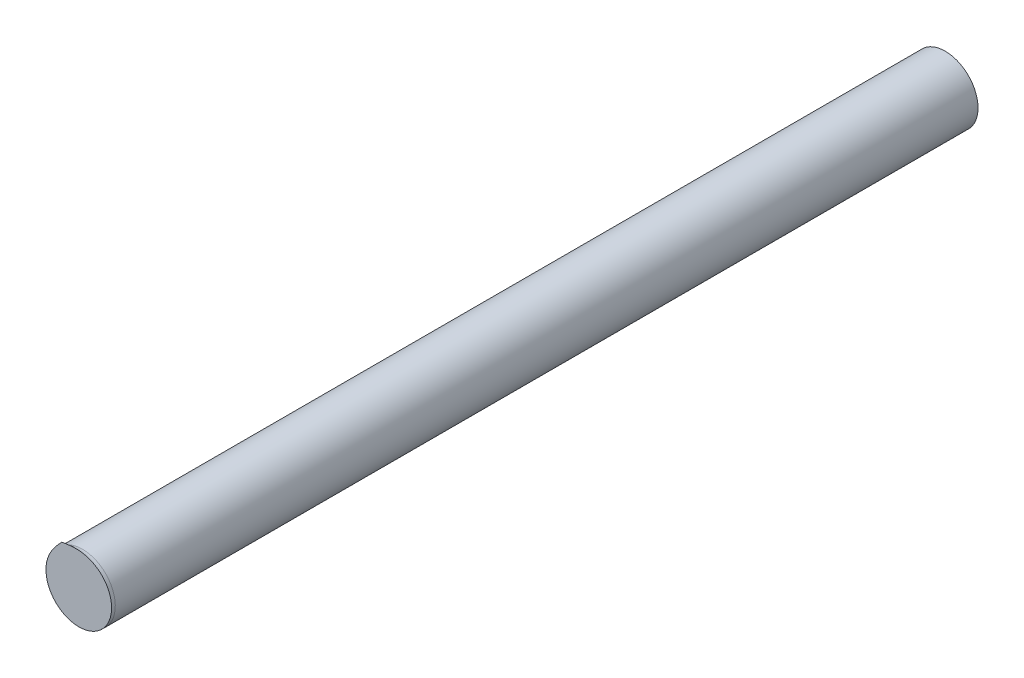
ISO-10303-21;
HEADER;
FILE_DESCRIPTION(('STEP AP214'),'2;1');
FILE_NAME('part.step','',(''),(''),'','','');
FILE_SCHEMA(('AUTOMOTIVE_DESIGN { 1 0 10303 214 1 1 1 1 }'));
ENDSEC;
DATA;
#1=APPLICATION_CONTEXT('core data for automotive mechanical design processes');
#2=APPLICATION_PROTOCOL_DEFINITION('international standard','automotive_design',2000,#1);
#3=PRODUCT_CONTEXT('',#1,'mechanical');
#4=PRODUCT('Part','Part','',(#3));
#5=PRODUCT_RELATED_PRODUCT_CATEGORY('part','',(#4));
#6=PRODUCT_DEFINITION_FORMATION('','',#4);
#7=PRODUCT_DEFINITION_CONTEXT('part definition',#1,'design');
#8=PRODUCT_DEFINITION('design','',#6,#7);
#9=PRODUCT_DEFINITION_SHAPE('','',#8);
#10=(LENGTH_UNIT() NAMED_UNIT(*) SI_UNIT(.MILLI.,.METRE.));
#11=(NAMED_UNIT(*) PLANE_ANGLE_UNIT() SI_UNIT($,.RADIAN.));
#12=(NAMED_UNIT(*) SI_UNIT($,.STERADIAN.) SOLID_ANGLE_UNIT());
#13=UNCERTAINTY_MEASURE_WITH_UNIT(LENGTH_MEASURE(1.E-05),#10,'distance_accuracy_value','');
#14=(GEOMETRIC_REPRESENTATION_CONTEXT(3) GLOBAL_UNCERTAINTY_ASSIGNED_CONTEXT((#13)) GLOBAL_UNIT_ASSIGNED_CONTEXT((#10,
#11,#12)) REPRESENTATION_CONTEXT('',''));
#15=CARTESIAN_POINT('',(0.,0.,0.));
#16=DIRECTION('',(0.,0.,1.));
#17=DIRECTION('',(1.,0.,0.));
#18=AXIS2_PLACEMENT_3D('',#15,#16,#17);
#19=CARTESIAN_POINT('',(2.55246250659386,0.304851094896286,-7.3152));
#20=DIRECTION('',(0.,0.,-1.));
#21=DIRECTION('',(-1.,0.,0.));
#22=AXIS2_PLACEMENT_3D('',#19,#20,#21);
#23=PLANE('',#22);
#24=CARTESIAN_POINT('',(2.55246250659386,0.304851094896286,-7.3152));
#25=DIRECTION('',(0.,0.,1.));
#26=DIRECTION('',(-0.467775560933805,0.88384728578701,0.));
#27=AXIS2_PLACEMENT_3D('',#24,#25,#26);
#28=CIRCLE('',#27,0.228600000000229);
#29=CARTESIAN_POINT('',(2.44552901336428,0.506898584427399,-7.3152));
#30=VERTEX_POINT('',#29);
#31=EDGE_CURVE('E11',#30,#30,#28,.T.);
#32=ORIENTED_EDGE('',*,*,#31,.F.);
#33=EDGE_LOOP('',(#32));
#34=FACE_BOUND('',#33,.T.);
#35=ADVANCED_FACE('F16',(#34),#23,.T.);
#36=CARTESIAN_POINT('',(2.55246250659386,0.304851094896286,-1.175004));
#37=DIRECTION('',(0.,0.,1.));
#38=DIRECTION('',(1.,0.,0.));
#39=AXIS2_PLACEMENT_3D('',#36,#37,#38);
#40=CYLINDRICAL_SURFACE('',#39,0.228600000000229);
#41=CARTESIAN_POINT('',(2.55246250659386,0.304851094896286,-1.2954));
#42=DIRECTION('',(0.,0.,1.));
#43=DIRECTION('',(0.467775560933805,-0.88384728578701,0.));
#44=AXIS2_PLACEMENT_3D('',#41,#42,#43);
#45=CIRCLE('',#44,0.228600000000229);
#46=CARTESIAN_POINT('',(2.65939599982343,0.102803605365174,-1.2954));
#47=VERTEX_POINT('',#46);
#48=EDGE_CURVE('E38',#47,#47,#45,.T.);
#49=ORIENTED_EDGE('',*,*,#48,.F.);
#50=EDGE_LOOP('',(#49));
#51=FACE_BOUND('',#50,.T.);
#52=ORIENTED_EDGE('',*,*,#31,.T.);
#53=EDGE_LOOP('',(#52));
#54=FACE_BOUND('',#53,.T.);
#55=ADVANCED_FACE('F50',(#51,#54),#40,.T.);
#56=CARTESIAN_POINT('',(2.55171172482898,0.3083632925686,-1.27));
#57=DIRECTION('',(0.,0.,1.));
#58=DIRECTION('',(1.,0.,0.));
#59=AXIS2_PLACEMENT_3D('',#56,#57,#58);
#60=PLANE('',#59);
#61=CARTESIAN_POINT('',(2.43364751411612,0.529348305486184,-1.27));
#62=CARTESIAN_POINT('',(2.42635052586074,0.521705783658482,-1.27));
#63=CARTESIAN_POINT('',(2.41254253847296,0.50720824298433,-1.27));
#64=CARTESIAN_POINT('',(2.39498799944063,0.487482414724102,-1.27));
#65=CARTESIAN_POINT('',(2.38012104805445,0.468948764031,-1.27));
#66=CARTESIAN_POINT('',(2.36751971721373,0.451136015617706,-1.27));
#67=CARTESIAN_POINT('',(2.356699596837,0.433497909899068,-1.27));
#68=CARTESIAN_POINT('',(2.34735019283277,0.415581999554176,-1.27));
#69=CARTESIAN_POINT('',(2.33919463154169,0.396685331612256,-1.27));
#70=CARTESIAN_POINT('',(2.33217170798558,0.376002038655074,-1.27));
#71=CARTESIAN_POINT('',(2.32651085980794,0.352605321209588,-1.27));
#72=CARTESIAN_POINT('',(2.32299404119821,0.32632483289259,-1.27));
#73=CARTESIAN_POINT('',(2.32246704625931,0.298825239669382,-1.27));
#74=CARTESIAN_POINT('',(2.32522895927395,0.270956818123888,-1.27));
#75=CARTESIAN_POINT('',(2.33123212224982,0.24387660314277,-1.27));
#76=CARTESIAN_POINT('',(2.3403209024484,0.217898868684602,-1.27));
#77=CARTESIAN_POINT('',(2.35231898357233,0.193341783894628,-1.27));
#78=CARTESIAN_POINT('',(2.36720094291656,0.170278263526688,-1.27));
#79=CARTESIAN_POINT('',(2.38459348013345,0.149280035834302,-1.27));
#80=CARTESIAN_POINT('',(2.40440048275635,0.130437856967681,-1.27));
#81=CARTESIAN_POINT('',(2.42618752668712,0.114157260826678,-1.27));
#82=CARTESIAN_POINT('',(2.44982811139062,0.100525664071536,-1.27));
#83=CARTESIAN_POINT('',(2.47480796386693,0.0898389845322888,-1.27));
#84=CARTESIAN_POINT('',(2.5009554002415,0.082163556756632,-1.27));
#85=CARTESIAN_POINT('',(2.52773443461297,0.0776582514923304,-1.27));
#86=CARTESIAN_POINT('',(2.55492577236582,0.0763534849951884,-1.27));
#87=CARTESIAN_POINT('',(2.58201242485992,0.0782789502587028,-1.27));
#88=CARTESIAN_POINT('',(2.60871851038846,0.0834042523099578,-1.27));
#89=CARTESIAN_POINT('',(2.63461812112152,0.0916649197247596,-1.27));
#90=CARTESIAN_POINT('',(2.65105288239722,0.0991448037875676,-1.27));
#91=CARTESIAN_POINT('',(2.65908311195776,0.10339479719493,-1.27));
#92=B_SPLINE_CURVE_WITH_KNOTS('',3,(#61,#62,#63,#64,#65,#66,#67,#68,#69,#70,#71,#72,#73,#74,#75,
#76,#77,#78,#79,#80,#81,#82,#83,#84,#85,#86,#87,#88,#89,#90,#91),.UNSPECIFIED.,.F.,.F.,(4,1,1,1,
1,1,1,1,1,1,1,1,1,1,1,1,1,1,1,1,1,1,1,1,1,1,1,1,4),(0.,0.03571428571429,0.07142857142857,
0.1071428571429,0.1428571428571,0.1785714285714,0.2142857142857,0.25,0.2857142857143,
0.3214285714286,0.3571428571429,0.3928571428571,0.4285714285714,0.4642857142857,0.5,
0.5357142857143,0.5714285714286,0.6071428571429,0.6428571428571,0.6785714285714,0.7142857142857,
0.75,0.7857142857143,0.8214285714286,0.8571428571429,0.8928571428571,0.9285714285714,
0.9642857142857,1.),.UNSPECIFIED.);
#93=CARTESIAN_POINT('',(2.43364751411612,0.529348305486184,-1.27));
#94=VERTEX_POINT('',#93);
#95=CARTESIAN_POINT('',(2.65908311195776,0.10339479719493,-1.27));
#96=VERTEX_POINT('',#95);
#97=EDGE_CURVE('E28',#94,#96,#92,.T.);
#98=ORIENTED_EDGE('',*,*,#97,.T.);
#99=CARTESIAN_POINT('',(2.43364751411612,0.529348305486184,-1.27));
#100=CARTESIAN_POINT('',(2.44418065560097,0.531102455274042,-1.27));
#101=CARTESIAN_POINT('',(2.46411770000747,0.534396471309568,-1.27));
#102=CARTESIAN_POINT('',(2.4904685074546,0.537822781515608,-1.27));
#103=CARTESIAN_POINT('',(2.51422193097687,0.53966891585813,-1.27));
#104=CARTESIAN_POINT('',(2.53604570067747,0.54003576303401,-1.27));
#105=CARTESIAN_POINT('',(2.55659948343546,0.539033043916516,-1.27));
#106=CARTESIAN_POINT('',(2.57645770606336,0.536690522003652,-1.27));
#107=CARTESIAN_POINT('',(2.59651388437358,0.532827493612122,-1.27));
#108=CARTESIAN_POINT('',(2.6175217094343,0.527022637428106,-1.27));
#109=CARTESIAN_POINT('',(2.64025162361878,0.518451324381282,-1.27));
#110=CARTESIAN_POINT('',(2.66374940811664,0.506666280142172,-1.27));
#111=CARTESIAN_POINT('',(2.68687190022818,0.49159318911036,-1.27));
#112=CARTESIAN_POINT('',(2.70853894100374,0.473447653261042,-1.27));
#113=CARTESIAN_POINT('',(2.7274960320938,0.453244266740286,-1.27));
#114=CARTESIAN_POINT('',(2.74377911403608,0.431189247508274,-1.27));
#115=CARTESIAN_POINT('',(2.75732219694224,0.407436723999446,-1.27));
#116=CARTESIAN_POINT('',(2.76799197849062,0.382169968642278,-1.27));
#117=CARTESIAN_POINT('',(2.77555152886806,0.355967893795326,-1.27));
#118=CARTESIAN_POINT('',(2.7799641273225,0.329032941946008,-1.27));
#119=CARTESIAN_POINT('',(2.78115453890916,0.301858548684794,-1.27));
#120=CARTESIAN_POINT('',(2.77911705729706,0.274684720949246,-1.27));
#121=CARTESIAN_POINT('',(2.77388952046234,0.248017301107052,-1.27));
#122=CARTESIAN_POINT('',(2.76553188406106,0.222124158301646,-1.27));
#123=CARTESIAN_POINT('',(2.75418611428122,0.197448521172247,-1.27));
#124=CARTESIAN_POINT('',(2.73998609838108,0.174268833433874,-1.27));
#125=CARTESIAN_POINT('',(2.72315520862408,0.152956688043721,-1.27));
#126=CARTESIAN_POINT('',(2.70391750906044,0.133782725866398,-1.27));
#127=CARTESIAN_POINT('',(2.68252496309022,0.117017292662838,-1.27));
#128=CARTESIAN_POINT('',(2.66710764894142,0.10764177780908,-1.27));
#129=CARTESIAN_POINT('',(2.65908311195776,0.10339479719493,-1.27));
#130=B_SPLINE_CURVE_WITH_KNOTS('',3,(#99,#100,#101,#102,#103,#104,#105,#106,#107,#108,#109,#110,
#111,#112,#113,#114,#115,#116,#117,#118,#119,#120,#121,#122,#123,#124,#125,#126,#127,#128,#129),
.UNSPECIFIED.,.F.,.F.,(4,1,1,1,1,1,1,1,1,1,1,1,1,1,1,1,1,1,1,1,1,1,1,1,1,1,1,1,4),(0.,
0.03571428571429,0.07142857142857,0.1071428571429,0.1428571428571,0.1785714285714,
0.2142857142857,0.25,0.2857142857143,0.3214285714286,0.3571428571429,0.3928571428571,
0.4285714285714,0.4642857142857,0.5,0.5357142857143,0.5714285714286,0.6071428571429,
0.6428571428571,0.6785714285714,0.7142857142857,0.75,0.7857142857143,0.8214285714286,
0.8571428571429,0.8928571428571,0.9285714285714,0.9642857142857,1.),.UNSPECIFIED.);
#131=EDGE_CURVE('E21',#94,#96,#130,.T.);
#132=ORIENTED_EDGE('',*,*,#131,.F.);
#133=EDGE_LOOP('',(#98,#132));
#134=FACE_BOUND('',#133,.T.);
#135=ADVANCED_FACE('F37',(#134),#60,.T.);
#136=CARTESIAN_POINT('',(2.43364751411612,0.529348305486184,-1.2954));
#137=DIRECTION('',(0.883847285787051,0.467775560933727,0.));
#138=DIRECTION('',(0.,0.,-1.));
#139=AXIS2_PLACEMENT_3D('',#136,#137,#138);
#140=TOROIDAL_SURFACE('',#139,0.254,0.2286);
#141=ORIENTED_EDGE('',*,*,#97,.F.);
#142=ORIENTED_EDGE('',*,*,#131,.T.);
#143=EDGE_LOOP('',(#141,#142));
#144=FACE_BOUND('',#143,.T.);
#145=ORIENTED_EDGE('',*,*,#48,.T.);
#146=EDGE_LOOP('',(#145));
#147=FACE_BOUND('',#146,.T.);
#148=ADVANCED_FACE('F18',(#144,#147),#140,.T.);
#149=CLOSED_SHELL('',(#35,#55,#135,#148));
#150=MANIFOLD_SOLID_BREP('B1',#149);
#151=ADVANCED_BREP_SHAPE_REPRESENTATION('',(#18,#150),#14);
#152=SHAPE_DEFINITION_REPRESENTATION(#9,#151);
ENDSEC;
END-ISO-10303-21;
